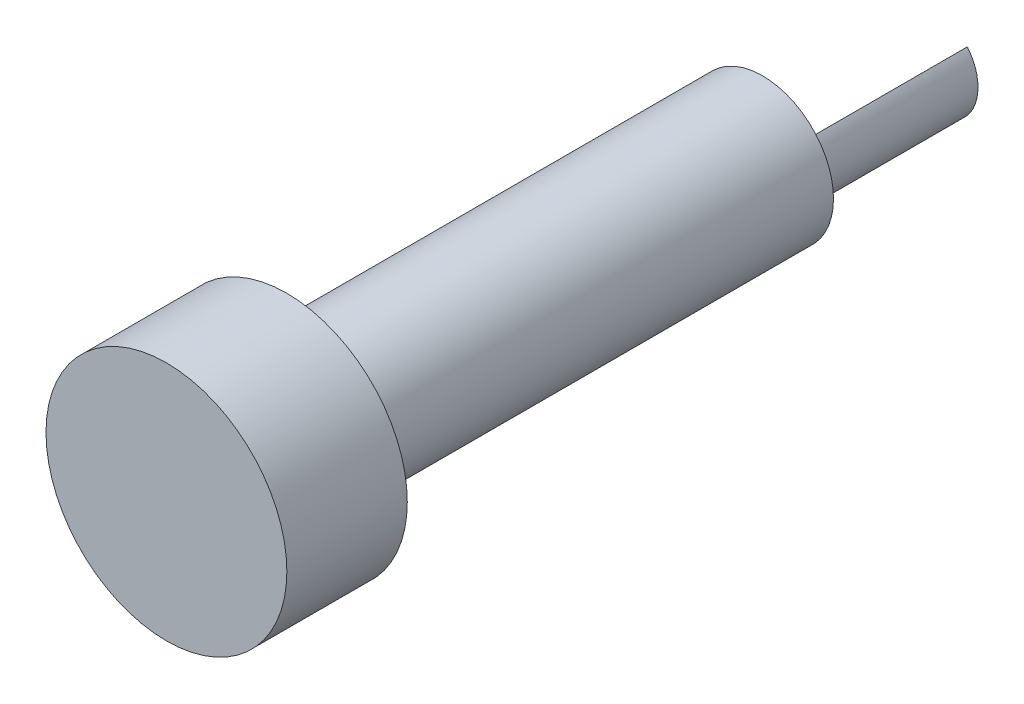
ISO-10303-21;
HEADER;
FILE_DESCRIPTION(('STEP AP214'),'2;1');
FILE_NAME('part.step','',(''),(''),'','','');
FILE_SCHEMA(('AUTOMOTIVE_DESIGN { 1 0 10303 214 1 1 1 1 }'));
ENDSEC;
DATA;
#1=APPLICATION_CONTEXT('core data for automotive mechanical design processes');
#2=APPLICATION_PROTOCOL_DEFINITION('international standard','automotive_design',2000,#1);
#3=PRODUCT_CONTEXT('',#1,'mechanical');
#4=PRODUCT('Part','Part','',(#3));
#5=PRODUCT_RELATED_PRODUCT_CATEGORY('part','',(#4));
#6=PRODUCT_DEFINITION_FORMATION('','',#4);
#7=PRODUCT_DEFINITION_CONTEXT('part definition',#1,'design');
#8=PRODUCT_DEFINITION('design','',#6,#7);
#9=PRODUCT_DEFINITION_SHAPE('','',#8);
#10=(LENGTH_UNIT() NAMED_UNIT(*) SI_UNIT(.MILLI.,.METRE.));
#11=(NAMED_UNIT(*) PLANE_ANGLE_UNIT() SI_UNIT($,.RADIAN.));
#12=(NAMED_UNIT(*) SI_UNIT($,.STERADIAN.) SOLID_ANGLE_UNIT());
#13=UNCERTAINTY_MEASURE_WITH_UNIT(LENGTH_MEASURE(1.E-05),#10,'distance_accuracy_value','');
#14=(GEOMETRIC_REPRESENTATION_CONTEXT(3) GLOBAL_UNCERTAINTY_ASSIGNED_CONTEXT((#13)) GLOBAL_UNIT_ASSIGNED_CONTEXT((#10,
#11,#12)) REPRESENTATION_CONTEXT('',''));
#15=CARTESIAN_POINT('',(0.,0.,0.));
#16=DIRECTION('',(0.,0.,1.));
#17=DIRECTION('',(1.,0.,0.));
#18=AXIS2_PLACEMENT_3D('',#15,#16,#17);
#19=CARTESIAN_POINT('',(0.,0.,7.112));
#20=DIRECTION('',(0.,0.,1.));
#21=DIRECTION('',(1.,0.,0.));
#22=AXIS2_PLACEMENT_3D('',#19,#20,#21);
#23=PLANE('',#22);
#24=CARTESIAN_POINT('',(0.,0.,7.112));
#25=DIRECTION('',(0.,0.,1.));
#26=DIRECTION('',(1.,0.,0.));
#27=AXIS2_PLACEMENT_3D('',#24,#25,#26);
#28=CIRCLE('',#27,1.975);
#29=CARTESIAN_POINT('',(1.525,-1.25499003980111,7.112));
#30=VERTEX_POINT('',#29);
#31=CARTESIAN_POINT('',(1.52499999999997,1.25499003980111,7.112));
#32=VERTEX_POINT('',#31);
#33=EDGE_CURVE('E85',#30,#32,#28,.F.);
#34=ORIENTED_EDGE('',*,*,#33,.F.);
#35=CARTESIAN_POINT('',(0.,0.,7.112));
#36=DIRECTION('',(0.,0.,1.));
#37=DIRECTION('',(1.,0.,0.));
#38=AXIS2_PLACEMENT_3D('',#35,#36,#37);
#39=CIRCLE('',#38,1.975);
#40=EDGE_CURVE('E97',#30,#32,#39,.T.);
#41=ORIENTED_EDGE('',*,*,#40,.T.);
#42=EDGE_LOOP('',(#34,#41));
#43=FACE_BOUND('',#42,.T.);
#44=CARTESIAN_POINT('',(0.,0.,7.112));
#45=DIRECTION('',(0.,0.,1.));
#46=DIRECTION('',(1.,0.,0.));
#47=AXIS2_PLACEMENT_3D('',#44,#45,#46);
#48=CIRCLE('',#47,2.99147738);
#49=CARTESIAN_POINT('',(2.99147738,0.,7.112));
#50=VERTEX_POINT('',#49);
#51=EDGE_CURVE('E94',#50,#50,#48,.T.);
#52=ORIENTED_EDGE('',*,*,#51,.F.);
#53=EDGE_LOOP('',(#52));
#54=FACE_BOUND('',#53,.T.);
#55=ADVANCED_FACE('F39',(#43,#54),#23,.F.);
#56=CARTESIAN_POINT('',(0.,0.,7.112));
#57=DIRECTION('',(0.,0.,1.));
#58=DIRECTION('',(1.,0.,0.));
#59=AXIS2_PLACEMENT_3D('',#56,#57,#58);
#60=CYLINDRICAL_SURFACE('',#59,2.99147738);
#61=ORIENTED_EDGE('',*,*,#51,.T.);
#62=EDGE_LOOP('',(#61));
#63=FACE_BOUND('',#62,.T.);
#64=CARTESIAN_POINT('',(0.,0.,27.178));
#65=DIRECTION('',(0.,0.,1.));
#66=DIRECTION('',(1.,0.,0.));
#67=AXIS2_PLACEMENT_3D('',#64,#65,#66);
#68=CIRCLE('',#67,2.99147738);
#69=CARTESIAN_POINT('',(2.99147738,0.,27.178));
#70=VERTEX_POINT('',#69);
#71=EDGE_CURVE('E93',#70,#70,#68,.T.);
#72=ORIENTED_EDGE('',*,*,#71,.F.);
#73=EDGE_LOOP('',(#72));
#74=FACE_BOUND('',#73,.T.);
#75=ADVANCED_FACE('F110',(#63,#74),#60,.T.);
#76=CARTESIAN_POINT('',(0.,0.,0.));
#77=DIRECTION('',(0.,0.,1.));
#78=DIRECTION('',(1.,0.,0.));
#79=AXIS2_PLACEMENT_3D('',#76,#77,#78);
#80=PLANE('',#79);
#81=CARTESIAN_POINT('',(0.,0.,0.));
#82=DIRECTION('',(0.,0.,1.));
#83=DIRECTION('',(1.,0.,0.));
#84=AXIS2_PLACEMENT_3D('',#81,#82,#83);
#85=CIRCLE('',#84,1.975);
#86=CARTESIAN_POINT('',(1.525,-1.25499003980111,0.));
#87=VERTEX_POINT('',#86);
#88=CARTESIAN_POINT('',(1.52499999999997,1.25499003980111,0.));
#89=VERTEX_POINT('',#88);
#90=EDGE_CURVE('E104',#87,#89,#85,.T.);
#91=ORIENTED_EDGE('',*,*,#90,.F.);
#92=DIRECTION('',(0.,1.,0.));
#93=VECTOR('',#92,1.);
#94=CARTESIAN_POINT('',(1.52499999999997,0.,0.));
#95=LINE('',#94,#93);
#96=EDGE_CURVE('E101',#87,#89,#95,.T.);
#97=ORIENTED_EDGE('',*,*,#96,.T.);
#98=EDGE_LOOP('',(#91,#97));
#99=FACE_BOUND('',#98,.T.);
#100=ADVANCED_FACE('F108',(#99),#80,.F.);
#101=CARTESIAN_POINT('',(1.52499999999997,0.,9.906));
#102=DIRECTION('',(-1.,0.,0.));
#103=DIRECTION('',(0.,-1.,0.));
#104=AXIS2_PLACEMENT_3D('',#101,#102,#103);
#105=PLANE('',#104);
#106=DIRECTION('',(0.,0.,-1.));
#107=VECTOR('',#106,1.);
#108=CARTESIAN_POINT('',(1.525,-1.25499003980111,9.906));
#109=LINE('',#108,#107);
#110=EDGE_CURVE('E11',#30,#87,#109,.T.);
#111=ORIENTED_EDGE('',*,*,#110,.F.);
#112=DIRECTION('',(0.,0.,-1.));
#113=VECTOR('',#112,1.);
#114=CARTESIAN_POINT('',(1.525,-1.25499003980111,20.066));
#115=LINE('',#114,#113);
#116=CARTESIAN_POINT('',(1.525,-1.25499003980111,20.066));
#117=VERTEX_POINT('',#116);
#118=EDGE_CURVE('E76',#117,#30,#115,.T.);
#119=ORIENTED_EDGE('',*,*,#118,.F.);
#120=DIRECTION('',(0.,1.,0.));
#121=VECTOR('',#120,1.);
#122=CARTESIAN_POINT('',(1.52499999999997,0.,20.066));
#123=LINE('',#122,#121);
#124=CARTESIAN_POINT('',(1.525,1.25499003980112,20.066));
#125=VERTEX_POINT('',#124);
#126=EDGE_CURVE('E72',#117,#125,#123,.T.);
#127=ORIENTED_EDGE('',*,*,#126,.T.);
#128=DIRECTION('',(0.,0.,-1.));
#129=VECTOR('',#128,1.);
#130=CARTESIAN_POINT('',(1.525,1.25499003980112,20.066));
#131=LINE('',#130,#129);
#132=EDGE_CURVE('E74',#125,#32,#131,.T.);
#133=ORIENTED_EDGE('',*,*,#132,.T.);
#134=DIRECTION('',(0.,0.,-1.));
#135=VECTOR('',#134,1.);
#136=CARTESIAN_POINT('',(1.52499999999997,1.25499003980111,9.906));
#137=LINE('',#136,#135);
#138=EDGE_CURVE('E43',#32,#89,#137,.T.);
#139=ORIENTED_EDGE('',*,*,#138,.T.);
#140=ORIENTED_EDGE('',*,*,#96,.F.);
#141=EDGE_LOOP('',(#111,#119,#127,#133,#139,#140));
#142=FACE_BOUND('',#141,.T.);
#143=ADVANCED_FACE('F41',(#142),#105,.T.);
#144=CARTESIAN_POINT('',(0.,0.,9.906));
#145=DIRECTION('',(0.,0.,-1.));
#146=DIRECTION('',(-1.,0.,0.));
#147=AXIS2_PLACEMENT_3D('',#144,#145,#146);
#148=CYLINDRICAL_SURFACE('',#147,1.975);
#149=ORIENTED_EDGE('',*,*,#40,.F.);
#150=ORIENTED_EDGE('',*,*,#110,.T.);
#151=ORIENTED_EDGE('',*,*,#90,.T.);
#152=ORIENTED_EDGE('',*,*,#138,.F.);
#153=EDGE_LOOP('',(#149,#150,#151,#152));
#154=FACE_BOUND('',#153,.T.);
#155=ADVANCED_FACE('F106',(#154),#148,.T.);
#156=CARTESIAN_POINT('',(0.,0.,20.066));
#157=DIRECTION('',(0.,0.,-1.));
#158=DIRECTION('',(-1.,0.,0.));
#159=AXIS2_PLACEMENT_3D('',#156,#157,#158);
#160=CYLINDRICAL_SURFACE('',#159,1.975);
#161=ORIENTED_EDGE('',*,*,#33,.T.);
#162=ORIENTED_EDGE('',*,*,#132,.F.);
#163=CARTESIAN_POINT('',(0.,0.,20.066));
#164=DIRECTION('',(0.,0.,1.));
#165=DIRECTION('',(1.,0.,0.));
#166=AXIS2_PLACEMENT_3D('',#163,#164,#165);
#167=CIRCLE('',#166,1.975);
#168=EDGE_CURVE('E79',#125,#117,#167,.T.);
#169=ORIENTED_EDGE('',*,*,#168,.T.);
#170=ORIENTED_EDGE('',*,*,#118,.T.);
#171=EDGE_LOOP('',(#161,#162,#169,#170));
#172=FACE_BOUND('',#171,.T.);
#173=ADVANCED_FACE('F83',(#172),#160,.F.);
#174=CARTESIAN_POINT('',(0.,0.,20.066));
#175=DIRECTION('',(0.,0.,1.));
#176=DIRECTION('',(1.,0.,0.));
#177=AXIS2_PLACEMENT_3D('',#174,#175,#176);
#178=PLANE('',#177);
#179=ORIENTED_EDGE('',*,*,#126,.F.);
#180=ORIENTED_EDGE('',*,*,#168,.F.);
#181=EDGE_LOOP('',(#179,#180));
#182=FACE_BOUND('',#181,.T.);
#183=ADVANCED_FACE('F87',(#182),#178,.F.);
#184=CARTESIAN_POINT('',(0.,0.,32.258));
#185=DIRECTION('',(0.,0.,-1.));
#186=DIRECTION('',(-1.,0.,0.));
#187=AXIS2_PLACEMENT_3D('',#184,#185,#186);
#188=CYLINDRICAL_SURFACE('',#187,5.08);
#189=CARTESIAN_POINT('',(0.,0.,32.258));
#190=DIRECTION('',(0.,0.,1.));
#191=DIRECTION('',(1.,0.,0.));
#192=AXIS2_PLACEMENT_3D('',#189,#190,#191);
#193=CIRCLE('',#192,5.08);
#194=CARTESIAN_POINT('',(5.08,0.,32.258));
#195=VERTEX_POINT('',#194);
#196=EDGE_CURVE('E80',#195,#195,#193,.T.);
#197=ORIENTED_EDGE('',*,*,#196,.F.);
#198=EDGE_LOOP('',(#197));
#199=FACE_BOUND('',#198,.T.);
#200=CARTESIAN_POINT('',(0.,0.,27.178));
#201=DIRECTION('',(0.,0.,1.));
#202=DIRECTION('',(1.,0.,0.));
#203=AXIS2_PLACEMENT_3D('',#200,#201,#202);
#204=CIRCLE('',#203,5.08);
#205=CARTESIAN_POINT('',(5.08,0.,27.178));
#206=VERTEX_POINT('',#205);
#207=EDGE_CURVE('E144',#206,#206,#204,.T.);
#208=ORIENTED_EDGE('',*,*,#207,.T.);
#209=EDGE_LOOP('',(#208));
#210=FACE_BOUND('',#209,.T.);
#211=ADVANCED_FACE('F129',(#199,#210),#188,.T.);
#212=CARTESIAN_POINT('',(0.,0.,32.258));
#213=DIRECTION('',(0.,0.,1.));
#214=DIRECTION('',(1.,0.,0.));
#215=AXIS2_PLACEMENT_3D('',#212,#213,#214);
#216=PLANE('',#215);
#217=ORIENTED_EDGE('',*,*,#196,.T.);
#218=EDGE_LOOP('',(#217));
#219=FACE_BOUND('',#218,.T.);
#220=ADVANCED_FACE('F132',(#219),#216,.T.);
#221=CARTESIAN_POINT('',(0.,0.,27.178));
#222=DIRECTION('',(0.,0.,1.));
#223=DIRECTION('',(1.,0.,0.));
#224=AXIS2_PLACEMENT_3D('',#221,#222,#223);
#225=PLANE('',#224);
#226=ORIENTED_EDGE('',*,*,#71,.T.);
#227=EDGE_LOOP('',(#226));
#228=FACE_BOUND('',#227,.T.);
#229=ORIENTED_EDGE('',*,*,#207,.F.);
#230=EDGE_LOOP('',(#229));
#231=FACE_BOUND('',#230,.T.);
#232=ADVANCED_FACE('F134',(#228,#231),#225,.F.);
#233=CLOSED_SHELL('',(#55,#75,#100,#143,#155,#173,#183,#211,#220,#232));
#234=MANIFOLD_SOLID_BREP('B2',#233);
#235=ADVANCED_BREP_SHAPE_REPRESENTATION('',(#18,#234),#14);
#236=SHAPE_DEFINITION_REPRESENTATION(#9,#235);
ENDSEC;
END-ISO-10303-21;
